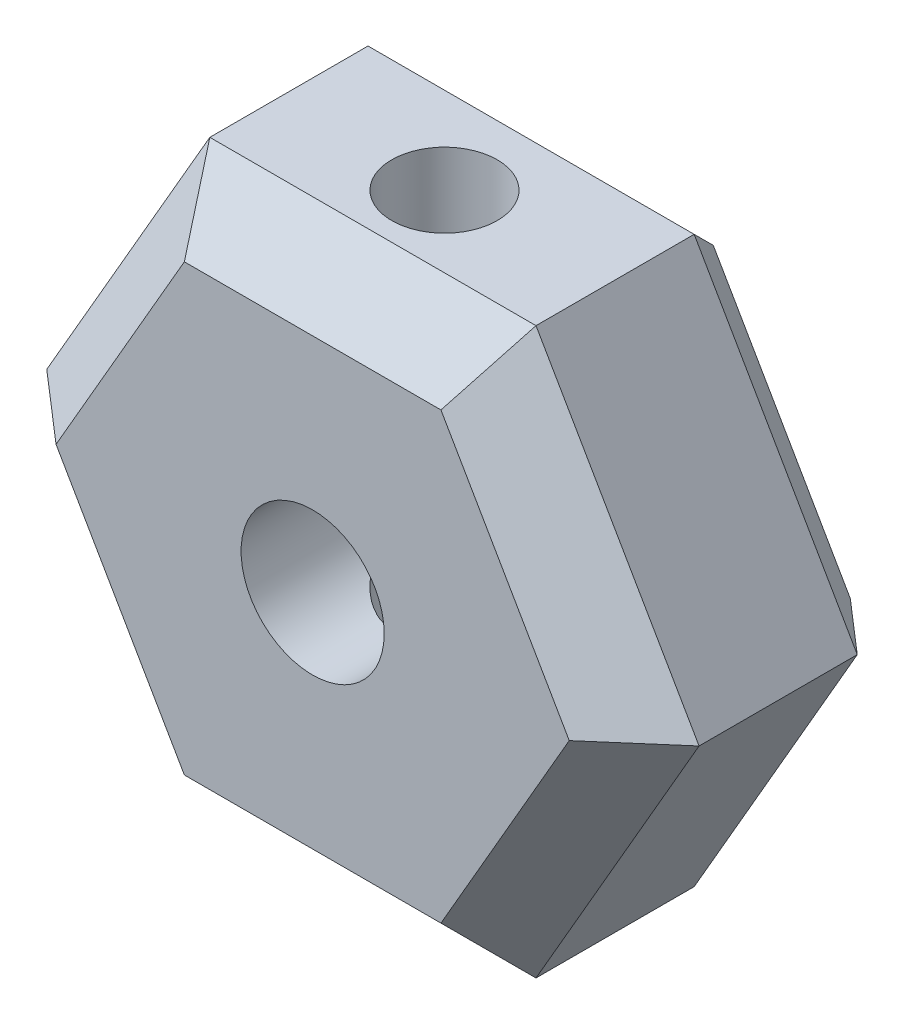
ISO-10303-21;
HEADER;
FILE_DESCRIPTION(('STEP AP214'),'2;1');
FILE_NAME('part.step','',(''),(''),'','','');
FILE_SCHEMA(('AUTOMOTIVE_DESIGN { 1 0 10303 214 1 1 1 1 }'));
ENDSEC;
DATA;
#1=APPLICATION_CONTEXT('core data for automotive mechanical design processes');
#2=APPLICATION_PROTOCOL_DEFINITION('international standard','automotive_design',2000,#1);
#3=PRODUCT_CONTEXT('',#1,'mechanical');
#4=PRODUCT('Part','Part','',(#3));
#5=PRODUCT_RELATED_PRODUCT_CATEGORY('part','',(#4));
#6=PRODUCT_DEFINITION_FORMATION('','',#4);
#7=PRODUCT_DEFINITION_CONTEXT('part definition',#1,'design');
#8=PRODUCT_DEFINITION('design','',#6,#7);
#9=PRODUCT_DEFINITION_SHAPE('','',#8);
#10=(LENGTH_UNIT() NAMED_UNIT(*) SI_UNIT(.MILLI.,.METRE.));
#11=(NAMED_UNIT(*) PLANE_ANGLE_UNIT() SI_UNIT($,.RADIAN.));
#12=(NAMED_UNIT(*) SI_UNIT($,.STERADIAN.) SOLID_ANGLE_UNIT());
#13=UNCERTAINTY_MEASURE_WITH_UNIT(LENGTH_MEASURE(1.E-05),#10,'distance_accuracy_value','');
#14=(GEOMETRIC_REPRESENTATION_CONTEXT(3) GLOBAL_UNCERTAINTY_ASSIGNED_CONTEXT((#13)) GLOBAL_UNIT_ASSIGNED_CONTEXT((#10,
#11,#12)) REPRESENTATION_CONTEXT('',''));
#15=CARTESIAN_POINT('',(0.,0.,0.));
#16=DIRECTION('',(0.,0.,1.));
#17=DIRECTION('',(1.,0.,0.));
#18=AXIS2_PLACEMENT_3D('',#15,#16,#17);
#19=CARTESIAN_POINT('',(0.,0.,7.));
#20=DIRECTION('',(0.,0.,1.));
#21=DIRECTION('',(1.,0.,0.));
#22=AXIS2_PLACEMENT_3D('',#19,#20,#21);
#23=PLANE('',#22);
#24=DIRECTION('',(-0.5,-0.866025403784439,0.));
#25=VECTOR('',#24,1.);
#26=CARTESIAN_POINT('',(-7.27461339178929,-0.800000000000001,7.));
#27=LINE('',#26,#25);
#28=CARTESIAN_POINT('',(-3.40636658821879,5.9,7.));
#29=VERTEX_POINT('',#28);
#30=CARTESIAN_POINT('',(-6.81273317643759,0.,7.));
#31=VERTEX_POINT('',#30);
#32=EDGE_CURVE('E138',#29,#31,#27,.T.);
#33=ORIENTED_EDGE('',*,*,#32,.T.);
#34=DIRECTION('',(0.5,-0.866025403784439,0.));
#35=VECTOR('',#34,1.);
#36=CARTESIAN_POINT('',(-2.94448637286709,-6.7,7.));
#37=LINE('',#36,#35);
#38=CARTESIAN_POINT('',(-3.40636658821879,-5.9,7.));
#39=VERTEX_POINT('',#38);
#40=EDGE_CURVE('E185',#31,#39,#37,.T.);
#41=ORIENTED_EDGE('',*,*,#40,.T.);
#42=DIRECTION('',(1.,0.,0.));
#43=VECTOR('',#42,1.);
#44=CARTESIAN_POINT('',(4.33012701892219,-5.9,7.));
#45=LINE('',#44,#43);
#46=CARTESIAN_POINT('',(3.40636658821879,-5.9,7.));
#47=VERTEX_POINT('',#46);
#48=EDGE_CURVE('E182',#39,#47,#45,.T.);
#49=ORIENTED_EDGE('',*,*,#48,.T.);
#50=DIRECTION('',(0.5,0.866025403784439,0.));
#51=VECTOR('',#50,1.);
#52=CARTESIAN_POINT('',(7.27461339178928,0.800000000000004,7.));
#53=LINE('',#52,#51);
#54=CARTESIAN_POINT('',(6.81273317643758,0.,7.));
#55=VERTEX_POINT('',#54);
#56=EDGE_CURVE('E179',#47,#55,#53,.T.);
#57=ORIENTED_EDGE('',*,*,#56,.T.);
#58=DIRECTION('',(-0.5,0.866025403784439,0.));
#59=VECTOR('',#58,1.);
#60=CARTESIAN_POINT('',(2.94448637286709,6.7,7.));
#61=LINE('',#60,#59);
#62=CARTESIAN_POINT('',(3.40636658821879,5.9,7.));
#63=VERTEX_POINT('',#62);
#64=EDGE_CURVE('E141',#55,#63,#61,.T.);
#65=ORIENTED_EDGE('',*,*,#64,.T.);
#66=DIRECTION('',(-1.,0.,0.));
#67=VECTOR('',#66,1.);
#68=CARTESIAN_POINT('',(-4.33012701892219,5.9,7.));
#69=LINE('',#68,#67);
#70=EDGE_CURVE('E133',#63,#29,#69,.T.);
#71=ORIENTED_EDGE('',*,*,#70,.T.);
#72=EDGE_LOOP('',(#33,#41,#49,#57,#65,#71));
#73=FACE_BOUND('',#72,.T.);
#74=CARTESIAN_POINT('',(0.,0.,7.));
#75=DIRECTION('',(0.,0.,1.));
#76=DIRECTION('',(1.,0.,0.));
#77=AXIS2_PLACEMENT_3D('',#74,#75,#76);
#78=CIRCLE('',#77,1.9);
#79=CARTESIAN_POINT('',(1.9,0.,7.));
#80=VERTEX_POINT('',#79);
#81=EDGE_CURVE('E576',#80,#80,#78,.T.);
#82=ORIENTED_EDGE('',*,*,#81,.F.);
#83=EDGE_LOOP('',(#82));
#84=FACE_BOUND('',#83,.T.);
#85=ADVANCED_FACE('F41',(#73,#84),#23,.T.);
#86=CARTESIAN_POINT('',(0.,0.,0.));
#87=DIRECTION('',(0.,0.,1.));
#88=DIRECTION('',(1.,0.,0.));
#89=AXIS2_PLACEMENT_3D('',#86,#87,#88);
#90=PLANE('',#89);
#91=DIRECTION('',(0.5,0.866025403784439,0.));
#92=VECTOR('',#91,1.);
#93=CARTESIAN_POINT('',(-5.45596004384196,3.15,0.));
#94=LINE('',#93,#92);
#95=CARTESIAN_POINT('',(-7.27461339178928,0.,0.));
#96=VERTEX_POINT('',#95);
#97=CARTESIAN_POINT('',(-3.63730669589464,6.3,0.));
#98=VERTEX_POINT('',#97);
#99=EDGE_CURVE('E225',#96,#98,#94,.T.);
#100=ORIENTED_EDGE('',*,*,#99,.T.);
#101=DIRECTION('',(1.,0.,0.));
#102=VECTOR('',#101,1.);
#103=CARTESIAN_POINT('',(0.,6.3,0.));
#104=LINE('',#103,#102);
#105=CARTESIAN_POINT('',(3.63730669589463,6.3,0.));
#106=VERTEX_POINT('',#105);
#107=EDGE_CURVE('E240',#98,#106,#104,.T.);
#108=ORIENTED_EDGE('',*,*,#107,.T.);
#109=DIRECTION('',(0.5,-0.866025403784439,0.));
#110=VECTOR('',#109,1.);
#111=CARTESIAN_POINT('',(5.45596004384196,3.15,0.));
#112=LINE('',#111,#110);
#113=CARTESIAN_POINT('',(7.27461339178927,0.,0.));
#114=VERTEX_POINT('',#113);
#115=EDGE_CURVE('E237',#106,#114,#112,.T.);
#116=ORIENTED_EDGE('',*,*,#115,.T.);
#117=DIRECTION('',(-0.5,-0.866025403784439,0.));
#118=VECTOR('',#117,1.);
#119=CARTESIAN_POINT('',(5.45596004384196,-3.14999999999999,0.));
#120=LINE('',#119,#118);
#121=CARTESIAN_POINT('',(3.63730669589463,-6.3,0.));
#122=VERTEX_POINT('',#121);
#123=EDGE_CURVE('E234',#114,#122,#120,.T.);
#124=ORIENTED_EDGE('',*,*,#123,.T.);
#125=DIRECTION('',(-1.,0.,0.));
#126=VECTOR('',#125,1.);
#127=CARTESIAN_POINT('',(0.,-6.3,0.));
#128=LINE('',#127,#126);
#129=CARTESIAN_POINT('',(-3.63730669589464,-6.3,0.));
#130=VERTEX_POINT('',#129);
#131=EDGE_CURVE('E231',#122,#130,#128,.T.);
#132=ORIENTED_EDGE('',*,*,#131,.T.);
#133=DIRECTION('',(-0.5,0.866025403784439,0.));
#134=VECTOR('',#133,1.);
#135=CARTESIAN_POINT('',(-5.45596004384196,-3.15,0.));
#136=LINE('',#135,#134);
#137=EDGE_CURVE('E228',#130,#96,#136,.T.);
#138=ORIENTED_EDGE('',*,*,#137,.T.);
#139=EDGE_LOOP('',(#100,#108,#116,#124,#132,#138));
#140=FACE_BOUND('',#139,.T.);
#141=CARTESIAN_POINT('',(0.,0.,0.));
#142=DIRECTION('',(0.,0.,1.));
#143=DIRECTION('',(1.,0.,0.));
#144=AXIS2_PLACEMENT_3D('',#141,#142,#143);
#145=CIRCLE('',#144,1.9);
#146=CARTESIAN_POINT('',(1.9,0.,0.));
#147=VERTEX_POINT('',#146);
#148=EDGE_CURVE('E582',#147,#147,#145,.T.);
#149=ORIENTED_EDGE('',*,*,#148,.T.);
#150=EDGE_LOOP('',(#149));
#151=FACE_BOUND('',#150,.T.);
#152=ADVANCED_FACE('F286',(#140,#151),#90,.F.);
#153=CARTESIAN_POINT('',(4.33012701892219,-7.5,7.));
#154=DIRECTION('',(-0.866025403784439,0.5,0.));
#155=DIRECTION('',(-0.5,-0.866025403784439,0.));
#156=AXIS2_PLACEMENT_3D('',#153,#154,#155);
#157=PLANE('',#156);
#158=DIRECTION('',(0.,0.,-1.));
#159=VECTOR('',#158,1.);
#160=CARTESIAN_POINT('',(4.33012701892219,-7.5,7.));
#161=LINE('',#160,#159);
#162=CARTESIAN_POINT('',(4.33012701892219,-7.5,5.39999999999999));
#163=VERTEX_POINT('',#162);
#164=CARTESIAN_POINT('',(4.33012701892219,-7.5,1.2));
#165=VERTEX_POINT('',#164);
#166=EDGE_CURVE('E572',#163,#165,#161,.T.);
#167=ORIENTED_EDGE('',*,*,#166,.T.);
#168=DIRECTION('',(0.5,0.866025403784439,0.));
#169=VECTOR('',#168,1.);
#170=CARTESIAN_POINT('',(4.33012701892219,-7.5,1.2));
#171=LINE('',#170,#169);
#172=CARTESIAN_POINT('',(8.66025403784438,0.,1.2));
#173=VERTEX_POINT('',#172);
#174=EDGE_CURVE('E247',#165,#173,#171,.T.);
#175=ORIENTED_EDGE('',*,*,#174,.T.);
#176=DIRECTION('',(0.,0.,-1.));
#177=VECTOR('',#176,1.);
#178=CARTESIAN_POINT('',(8.66025403784438,0.,7.));
#179=LINE('',#178,#177);
#180=CARTESIAN_POINT('',(8.66025403784438,0.,5.39999999999999));
#181=VERTEX_POINT('',#180);
#182=EDGE_CURVE('E162',#181,#173,#179,.T.);
#183=ORIENTED_EDGE('',*,*,#182,.F.);
#184=DIRECTION('',(-0.5,-0.866025403784439,0.));
#185=VECTOR('',#184,1.);
#186=CARTESIAN_POINT('',(4.33012701892219,-7.5,5.39999999999999));
#187=LINE('',#186,#185);
#188=EDGE_CURVE('E195',#181,#163,#187,.T.);
#189=ORIENTED_EDGE('',*,*,#188,.T.);
#190=EDGE_LOOP('',(#167,#175,#183,#189));
#191=FACE_BOUND('',#190,.T.);
#192=ADVANCED_FACE('F341',(#191),#157,.F.);
#193=CARTESIAN_POINT('',(8.66025403784438,0.,7.));
#194=DIRECTION('',(-0.866025403784439,-0.5,0.));
#195=DIRECTION('',(0.5,-0.866025403784439,0.));
#196=AXIS2_PLACEMENT_3D('',#193,#194,#195);
#197=PLANE('',#196);
#198=ORIENTED_EDGE('',*,*,#182,.T.);
#199=DIRECTION('',(-0.5,0.866025403784439,0.));
#200=VECTOR('',#199,1.);
#201=CARTESIAN_POINT('',(8.66025403784438,0.,1.2));
#202=LINE('',#201,#200);
#203=CARTESIAN_POINT('',(4.33012701892219,7.5,1.2));
#204=VERTEX_POINT('',#203);
#205=EDGE_CURVE('E244',#173,#204,#202,.T.);
#206=ORIENTED_EDGE('',*,*,#205,.T.);
#207=DIRECTION('',(0.,0.,-1.));
#208=VECTOR('',#207,1.);
#209=CARTESIAN_POINT('',(4.33012701892219,7.5,7.));
#210=LINE('',#209,#208);
#211=CARTESIAN_POINT('',(4.33012701892219,7.5,5.39999999999999));
#212=VERTEX_POINT('',#211);
#213=EDGE_CURVE('E166',#212,#204,#210,.T.);
#214=ORIENTED_EDGE('',*,*,#213,.F.);
#215=DIRECTION('',(0.5,-0.866025403784439,0.));
#216=VECTOR('',#215,1.);
#217=CARTESIAN_POINT('',(8.66025403784438,0.,5.39999999999999));
#218=LINE('',#217,#216);
#219=EDGE_CURVE('E198',#212,#181,#218,.T.);
#220=ORIENTED_EDGE('',*,*,#219,.T.);
#221=EDGE_LOOP('',(#198,#206,#214,#220));
#222=FACE_BOUND('',#221,.T.);
#223=ADVANCED_FACE('F299',(#222),#197,.F.);
#224=CARTESIAN_POINT('',(4.33012701892219,7.5,7.));
#225=DIRECTION('',(0.,-1.,0.));
#226=DIRECTION('',(0.,0.,-1.));
#227=AXIS2_PLACEMENT_3D('',#224,#225,#226);
#228=PLANE('',#227);
#229=CARTESIAN_POINT('',(0.,7.50000000000001,3.5));
#230=DIRECTION('',(0.,-1.,0.));
#231=DIRECTION('',(0.,0.,-1.));
#232=AXIS2_PLACEMENT_3D('',#229,#230,#231);
#233=CIRCLE('',#232,1.4);
#234=CARTESIAN_POINT('',(0.,7.50000000000001,2.1));
#235=VERTEX_POINT('',#234);
#236=EDGE_CURVE('E318',#235,#235,#233,.T.);
#237=ORIENTED_EDGE('',*,*,#236,.T.);
#238=EDGE_LOOP('',(#237));
#239=FACE_BOUND('',#238,.T.);
#240=ORIENTED_EDGE('',*,*,#213,.T.);
#241=DIRECTION('',(-1.,0.,0.));
#242=VECTOR('',#241,1.);
#243=CARTESIAN_POINT('',(4.33012701892219,7.5,1.2));
#244=LINE('',#243,#242);
#245=CARTESIAN_POINT('',(-4.33012701892219,7.5,1.2));
#246=VERTEX_POINT('',#245);
#247=EDGE_CURVE('E206',#204,#246,#244,.T.);
#248=ORIENTED_EDGE('',*,*,#247,.T.);
#249=DIRECTION('',(0.,0.,-1.));
#250=VECTOR('',#249,1.);
#251=CARTESIAN_POINT('',(-4.33012701892219,7.5,7.));
#252=LINE('',#251,#250);
#253=CARTESIAN_POINT('',(-4.33012701892219,7.5,5.39999999999999));
#254=VERTEX_POINT('',#253);
#255=EDGE_CURVE('E306',#254,#246,#252,.T.);
#256=ORIENTED_EDGE('',*,*,#255,.F.);
#257=DIRECTION('',(1.,0.,0.));
#258=VECTOR('',#257,1.);
#259=CARTESIAN_POINT('',(4.33012701892219,7.5,5.39999999999999));
#260=LINE('',#259,#258);
#261=EDGE_CURVE('E151',#254,#212,#260,.T.);
#262=ORIENTED_EDGE('',*,*,#261,.T.);
#263=EDGE_LOOP('',(#240,#248,#256,#262));
#264=FACE_BOUND('',#263,.T.);
#265=ADVANCED_FACE('F303',(#239,#264),#228,.F.);
#266=CARTESIAN_POINT('',(-4.33012701892219,7.5,7.));
#267=DIRECTION('',(0.866025403784439,-0.5,0.));
#268=DIRECTION('',(0.5,0.866025403784439,0.));
#269=AXIS2_PLACEMENT_3D('',#266,#267,#268);
#270=PLANE('',#269);
#271=ORIENTED_EDGE('',*,*,#255,.T.);
#272=DIRECTION('',(-0.5,-0.866025403784439,0.));
#273=VECTOR('',#272,1.);
#274=CARTESIAN_POINT('',(-4.33012701892219,7.5,1.2));
#275=LINE('',#274,#273);
#276=CARTESIAN_POINT('',(-8.66025403784439,0.,1.2));
#277=VERTEX_POINT('',#276);
#278=EDGE_CURVE('E11',#246,#277,#275,.T.);
#279=ORIENTED_EDGE('',*,*,#278,.T.);
#280=DIRECTION('',(0.,0.,-1.));
#281=VECTOR('',#280,1.);
#282=CARTESIAN_POINT('',(-8.66025403784439,0.,7.));
#283=LINE('',#282,#281);
#284=CARTESIAN_POINT('',(-8.66025403784439,0.,5.39999999999999));
#285=VERTEX_POINT('',#284);
#286=EDGE_CURVE('E309',#285,#277,#283,.T.);
#287=ORIENTED_EDGE('',*,*,#286,.F.);
#288=DIRECTION('',(0.5,0.866025403784439,0.));
#289=VECTOR('',#288,1.);
#290=CARTESIAN_POINT('',(-4.33012701892219,7.5,5.39999999999999));
#291=LINE('',#290,#289);
#292=EDGE_CURVE('E203',#285,#254,#291,.T.);
#293=ORIENTED_EDGE('',*,*,#292,.T.);
#294=EDGE_LOOP('',(#271,#279,#287,#293));
#295=FACE_BOUND('',#294,.T.);
#296=ADVANCED_FACE('F350',(#295),#270,.F.);
#297=CARTESIAN_POINT('',(-8.66025403784439,0.,7.));
#298=DIRECTION('',(0.866025403784439,0.5,0.));
#299=DIRECTION('',(-0.5,0.866025403784439,0.));
#300=AXIS2_PLACEMENT_3D('',#297,#298,#299);
#301=PLANE('',#300);
#302=ORIENTED_EDGE('',*,*,#286,.T.);
#303=DIRECTION('',(0.5,-0.866025403784439,0.));
#304=VECTOR('',#303,1.);
#305=CARTESIAN_POINT('',(-8.66025403784439,0.,1.2));
#306=LINE('',#305,#304);
#307=CARTESIAN_POINT('',(-4.33012701892219,-7.5,1.2));
#308=VERTEX_POINT('',#307);
#309=EDGE_CURVE('E52',#277,#308,#306,.T.);
#310=ORIENTED_EDGE('',*,*,#309,.T.);
#311=DIRECTION('',(0.,0.,-1.));
#312=VECTOR('',#311,1.);
#313=CARTESIAN_POINT('',(-4.33012701892219,-7.5,7.));
#314=LINE('',#313,#312);
#315=CARTESIAN_POINT('',(-4.33012701892219,-7.5,5.39999999999999));
#316=VERTEX_POINT('',#315);
#317=EDGE_CURVE('E575',#316,#308,#314,.T.);
#318=ORIENTED_EDGE('',*,*,#317,.F.);
#319=DIRECTION('',(-0.5,0.866025403784439,0.));
#320=VECTOR('',#319,1.);
#321=CARTESIAN_POINT('',(-8.66025403784439,0.,5.39999999999999));
#322=LINE('',#321,#320);
#323=EDGE_CURVE('E188',#316,#285,#322,.T.);
#324=ORIENTED_EDGE('',*,*,#323,.T.);
#325=EDGE_LOOP('',(#302,#310,#318,#324));
#326=FACE_BOUND('',#325,.T.);
#327=ADVANCED_FACE('F346',(#326),#301,.F.);
#328=CARTESIAN_POINT('',(-4.33012701892219,-7.5,7.));
#329=DIRECTION('',(0.,1.,0.));
#330=DIRECTION('',(0.,0.,1.));
#331=AXIS2_PLACEMENT_3D('',#328,#329,#330);
#332=PLANE('',#331);
#333=CARTESIAN_POINT('',(0.,-7.5,3.5));
#334=DIRECTION('',(0.,-1.,0.));
#335=DIRECTION('',(0.,0.,-1.));
#336=AXIS2_PLACEMENT_3D('',#333,#334,#335);
#337=CIRCLE('',#336,1.4);
#338=CARTESIAN_POINT('',(0.,-7.5,2.1));
#339=VERTEX_POINT('',#338);
#340=EDGE_CURVE('E221',#339,#339,#337,.T.);
#341=ORIENTED_EDGE('',*,*,#340,.F.);
#342=EDGE_LOOP('',(#341));
#343=FACE_BOUND('',#342,.T.);
#344=ORIENTED_EDGE('',*,*,#317,.T.);
#345=DIRECTION('',(1.,0.,0.));
#346=VECTOR('',#345,1.);
#347=CARTESIAN_POINT('',(-4.33012701892219,-7.5,1.2));
#348=LINE('',#347,#346);
#349=EDGE_CURVE('E250',#308,#165,#348,.T.);
#350=ORIENTED_EDGE('',*,*,#349,.T.);
#351=ORIENTED_EDGE('',*,*,#166,.F.);
#352=DIRECTION('',(-1.,0.,0.));
#353=VECTOR('',#352,1.);
#354=CARTESIAN_POINT('',(-4.33012701892219,-7.5,5.39999999999999));
#355=LINE('',#354,#353);
#356=EDGE_CURVE('E192',#163,#316,#355,.T.);
#357=ORIENTED_EDGE('',*,*,#356,.T.);
#358=EDGE_LOOP('',(#344,#350,#351,#357));
#359=FACE_BOUND('',#358,.T.);
#360=ADVANCED_FACE('F334',(#343,#359),#332,.F.);
#361=CARTESIAN_POINT('',(0.,0.,7.));
#362=DIRECTION('',(0.,0.,-1.));
#363=DIRECTION('',(-1.,0.,0.));
#364=AXIS2_PLACEMENT_3D('',#361,#362,#363);
#365=CYLINDRICAL_SURFACE('',#364,1.9);
#366=CARTESIAN_POINT('',(0.,1.9,2.1));
#367=CARTESIAN_POINT('',(0.0687841434595782,1.90000211675382,2.09999772030073));
#368=CARTESIAN_POINT('',(0.137557244291258,1.89623451105031,2.10509782059149));
#369=CARTESIAN_POINT('',(0.272864783479331,1.88153649341743,2.12514519340404));
#370=CARTESIAN_POINT('',(0.339398348980658,1.87060332194124,2.14009625966485));
#371=CARTESIAN_POINT('',(0.468038145568906,1.84262254648485,2.17885052152287));
#372=CARTESIAN_POINT('',(0.530165186822579,1.82560634621971,2.20260827532655));
#373=CARTESIAN_POINT('',(0.649190666680503,1.78675019381165,2.25788000539543));
#374=CARTESIAN_POINT('',(0.706088376783239,1.76490957101335,2.28939506009268));
#375=CARTESIAN_POINT('',(0.818942367525374,1.71565218990302,2.36234678927538));
#376=CARTESIAN_POINT('',(0.874336456337021,1.68790811360331,2.40442732628479));
#377=CARTESIAN_POINT('',(0.977757516272454,1.63018590802803,2.49563268980914));
#378=CARTESIAN_POINT('',(1.0257733082431,1.60020448900086,2.54476799160342));
#379=CARTESIAN_POINT('',(1.1227726383369,1.53409877084207,2.65970008829287));
#380=CARTESIAN_POINT('',(1.17009752813755,1.49792341290221,2.72687440595895));
#381=CARTESIAN_POINT('',(1.25292258094274,1.42935750652528,2.86992439799439));
#382=CARTESIAN_POINT('',(1.28843993538106,1.39696150049659,2.94578720371571));
#383=CARTESIAN_POINT('',(1.33634282184493,1.35088939667092,3.07884872008069));
#384=CARTESIAN_POINT('',(1.35249119749808,1.33457944630724,3.13376823912102));
#385=CARTESIAN_POINT('',(1.37807261223795,1.30815044302801,3.24653721218218));
#386=CARTESIAN_POINT('',(1.38752086905248,1.29801736821088,3.30437970490783));
#387=CARTESIAN_POINT('',(1.39909204373161,1.28554385897506,3.42214532495909));
#388=CARTESIAN_POINT('',(1.40115618788817,1.28326595276215,3.48208132823501));
#389=CARTESIAN_POINT('',(1.39759712393426,1.28713866428736,3.601464506483));
#390=CARTESIAN_POINT('',(1.39196893842244,1.29329473932631,3.66091133988568));
#391=CARTESIAN_POINT('',(1.37254954230662,1.3138949171613,3.78347245441111));
#392=CARTESIAN_POINT('',(1.35796596470102,1.32913868670872,3.84631981592621));
#393=CARTESIAN_POINT('',(1.32105950630593,1.36582374602091,3.96781936740607));
#394=CARTESIAN_POINT('',(1.29871816600748,1.38727979742079,4.02646114502663));
#395=CARTESIAN_POINT('',(1.23795410066304,1.44210909727707,4.15919771216748));
#396=CARTESIAN_POINT('',(1.19663768664491,1.47700180062216,4.23133203732312));
#397=CARTESIAN_POINT('',(1.10253498299398,1.54852378501615,4.3667308670521));
#398=CARTESIAN_POINT('',(1.04973529089275,1.58515505581053,4.4299848639788));
#399=CARTESIAN_POINT('',(0.932324855731339,1.65697985430152,4.54775095156294));
#400=CARTESIAN_POINT('',(0.867549090163071,1.69214363909706,4.60211795534442));
#401=CARTESIAN_POINT('',(0.727423856460964,1.75692310767703,4.6991993734987));
#402=CARTESIAN_POINT('',(0.65209913521971,1.78655140804411,4.74194039006743));
#403=CARTESIAN_POINT('',(0.512825284107027,1.83054732992554,4.80432137792727));
#404=CARTESIAN_POINT('',(0.450888239883205,1.84687991788722,4.82707358387114));
#405=CARTESIAN_POINT('',(0.323205719891138,1.87343976725731,4.86379589579124));
#406=CARTESIAN_POINT('',(0.257463105032741,1.88367155131224,4.8777725076974));
#407=CARTESIAN_POINT('',(0.123657677259072,1.8971679061331,4.896168192157));
#408=CARTESIAN_POINT('',(0.0555865937172618,1.90040428030241,4.90054858591717));
#409=CARTESIAN_POINT('',(-0.0804205443920804,1.89951457079674,4.89934128244));
#410=CARTESIAN_POINT('',(-0.148356600555419,1.89538857465738,4.89375370371785));
#411=CARTESIAN_POINT('',(-0.277679498361625,1.88065567505121,4.87364770944877));
#412=CARTESIAN_POINT('',(-0.339209029698174,1.87047438975612,4.85971541418794));
#413=CARTESIAN_POINT('',(-0.458811637625449,1.84478643770938,4.82415548731847));
#414=CARTESIAN_POINT('',(-0.516883984442782,1.82927865123618,4.80252623764401));
#415=CARTESIAN_POINT('',(-0.632897189041982,1.79260262127453,4.75051625687439));
#416=CARTESIAN_POINT('',(-0.69048141238114,1.77108967750562,4.719588591386));
#417=CARTESIAN_POINT('',(-0.79979497178779,1.72448986042353,4.65087050035516));
#418=CARTESIAN_POINT('',(-0.851520828623615,1.69940088310293,4.61307603101453));
#419=CARTESIAN_POINT('',(-0.95766500898285,1.64229744742273,4.52397406455165));
#420=CARTESIAN_POINT('',(-1.01083973215656,1.60985639823868,4.47145946486776));
#421=CARTESIAN_POINT('',(-1.10815061627961,1.54448662400514,4.35880825231534));
#422=CARTESIAN_POINT('',(-1.15227777154495,1.51155744770237,4.29866414069101));
#423=CARTESIAN_POINT('',(-1.22741320273067,1.45105818446999,4.17684088466011));
#424=CARTESIAN_POINT('',(-1.25924013015879,1.42327202856292,4.11577616264497));
#425=CARTESIAN_POINT('',(-1.31408148827124,1.37279947319823,3.98786142514982));
#426=CARTESIAN_POINT('',(-1.33711413712893,1.35010257160306,3.92102372527513));
#427=CARTESIAN_POINT('',(-1.36880717362255,1.3178598928989,3.7988956326572));
#428=CARTESIAN_POINT('',(-1.37958548148078,1.30646842792046,3.7446547979337));
#429=CARTESIAN_POINT('',(-1.39464711391758,1.29038225864231,3.63433536008509));
#430=CARTESIAN_POINT('',(-1.39894094621448,1.28567672091701,3.57825988089946));
#431=CARTESIAN_POINT('',(-1.40071377486937,1.28374606442873,3.46571122908163));
#432=CARTESIAN_POINT('',(-1.39817421574113,1.28654131334983,3.40923738976344));
#433=CARTESIAN_POINT('',(-1.38645346148569,1.29915949759009,3.29776307703709));
#434=CARTESIAN_POINT('',(-1.37726304936555,1.3089921854389,3.24276475826968));
#435=CARTESIAN_POINT('',(-1.34946308549456,1.33770101461708,3.12068467080471));
#436=CARTESIAN_POINT('',(-1.32895378563643,1.35832426273479,3.05445807125887));
#437=CARTESIAN_POINT('',(-1.27936661386423,1.40512732603195,2.92737455741859));
#438=CARTESIAN_POINT('',(-1.25026772957364,1.43132072280087,2.86653129221016));
#439=CARTESIAN_POINT('',(-1.17495353991677,1.4941618402374,2.73394586612688));
#440=CARTESIAN_POINT('',(-1.12622371662423,1.53166236244231,2.66403484676995));
#441=CARTESIAN_POINT('',(-1.01687677591846,1.60634979393746,2.53398838419829));
#442=CARTESIAN_POINT('',(-0.956252969610223,1.64353651442241,2.47385847661519));
#443=CARTESIAN_POINT('',(-0.823411351752335,1.71396180588537,2.36447667071742));
#444=CARTESIAN_POINT('',(-0.751157989580684,1.7471877087732,2.31525926447447));
#445=CARTESIAN_POINT('',(-0.596339997818307,1.80587426435838,2.23030609839017));
#446=CARTESIAN_POINT('',(-0.513801345298897,1.83135394255661,2.19453725548184));
#447=CARTESIAN_POINT('',(-0.359481932186761,1.86698759286799,2.14505869164714));
#448=CARTESIAN_POINT('',(-0.289178023539132,1.87925423688163,2.12826663570456));
#449=CARTESIAN_POINT('',(-0.145910191409919,1.89575546939163,2.10574379885368));
#450=CARTESIAN_POINT('',(-0.0729488855405462,1.89999775508097,2.10000241773049));
#451=CARTESIAN_POINT('',(0.,1.9,2.1));
#452=B_SPLINE_CURVE_WITH_KNOTS('',3,(#366,#367,#368,#369,#370,#371,#372,#373,#374,#375,#376,
#377,#378,#379,#380,#381,#382,#383,#384,#385,#386,#387,#388,#389,#390,#391,#392,#393,#394,#395,
#396,#397,#398,#399,#400,#401,#402,#403,#404,#405,#406,#407,#408,#409,#410,#411,#412,#413,#414,
#415,#416,#417,#418,#419,#420,#421,#422,#423,#424,#425,#426,#427,#428,#429,#430,#431,#432,#433,
#434,#435,#436,#437,#438,#439,#440,#441,#442,#443,#444,#445,#446,#447,#448,#449,#450,#451),
.UNSPECIFIED.,.T.,.F.,(4,2,2,2,2,2,2,2,2,2,2,2,2,2,2,2,2,2,2,2,2,2,2,2,2,2,2,2,2,2,2,2,2,2,2,2,
2,2,2,2,2,2,4),(0.,0.206054152649566,0.412187705933169,0.617272105785463,0.822385032909205,
1.04626017687981,1.27047124768057,1.53867477711422,1.80648608196649,1.98443125268575,
2.16197095741648,2.34092068043603,2.51998624955705,2.71778447281641,2.91605661701214,
3.18513708047876,3.4545332972428,3.7279635217869,4.00076272632448,4.20384832896068,
4.40678319244113,4.61053451760019,4.81428342025409,5.00516864319834,5.19609401806172,
5.40176683775088,5.60756117119214,5.85106746176391,6.09481496712449,6.31684102311155,
6.53840460301532,6.707106620025,6.87553497071421,7.04442113531016,7.21354179777154,
7.42934577192715,7.64568209703957,7.92363179507935,8.20173825585369,8.48071160198203,
8.75899412072013,8.97773436798237,9.1962646867559),.UNSPECIFIED.);
#453=CARTESIAN_POINT('',(0.,1.9,2.1));
#454=VERTEX_POINT('',#453);
#455=EDGE_CURVE('E169',#454,#454,#452,.T.);
#456=ORIENTED_EDGE('',*,*,#455,.F.);
#457=EDGE_LOOP('',(#456));
#458=FACE_BOUND('',#457,.T.);
#459=CARTESIAN_POINT('',(0.,-1.9,2.1));
#460=CARTESIAN_POINT('',(-0.0687841434595843,-1.90000211675382,2.09999772030073));
#461=CARTESIAN_POINT('',(-0.137557244291264,-1.89623451105031,2.10509782059149));
#462=CARTESIAN_POINT('',(-0.272864783479337,-1.88153649341743,2.12514519340404));
#463=CARTESIAN_POINT('',(-0.339398348980665,-1.87060332194124,2.14009625966485));
#464=CARTESIAN_POINT('',(-0.468038145568912,-1.84262254648485,2.17885052152287));
#465=CARTESIAN_POINT('',(-0.530165186822585,-1.82560634621971,2.20260827532655));
#466=CARTESIAN_POINT('',(-0.64919066668051,-1.78675019381165,2.25788000539543));
#467=CARTESIAN_POINT('',(-0.706088376783245,-1.76490957101335,2.28939506009268));
#468=CARTESIAN_POINT('',(-0.81894236752538,-1.71565218990302,2.36234678927539));
#469=CARTESIAN_POINT('',(-0.874336456337027,-1.6879081136033,2.40442732628479));
#470=CARTESIAN_POINT('',(-0.97775751627246,-1.63018590802802,2.49563268980914));
#471=CARTESIAN_POINT('',(-1.02577330824311,-1.60020448900085,2.54476799160342));
#472=CARTESIAN_POINT('',(-1.12277263833691,-1.53409877084206,2.65970008829287));
#473=CARTESIAN_POINT('',(-1.17009752813756,-1.49792341290221,2.72687440595895));
#474=CARTESIAN_POINT('',(-1.25292258094275,-1.42935750652527,2.86992439799439));
#475=CARTESIAN_POINT('',(-1.28843993538106,-1.39696150049659,2.94578720371571));
#476=CARTESIAN_POINT('',(-1.33634282184494,-1.35088939667091,3.0788487200807));
#477=CARTESIAN_POINT('',(-1.35249119749809,-1.33457944630723,3.13376823912102));
#478=CARTESIAN_POINT('',(-1.37807261223795,-1.308150443028,3.24653721218218));
#479=CARTESIAN_POINT('',(-1.38752086905249,-1.29801736821087,3.30437970490783));
#480=CARTESIAN_POINT('',(-1.39909204373161,-1.28554385897506,3.42214532495909));
#481=CARTESIAN_POINT('',(-1.40115618788818,-1.28326595276214,3.48208132823501));
#482=CARTESIAN_POINT('',(-1.39759712393426,-1.28713866428735,3.601464506483));
#483=CARTESIAN_POINT('',(-1.39196893842244,-1.29329473932631,3.66091133988567));
#484=CARTESIAN_POINT('',(-1.37254954230663,-1.3138949171613,3.78347245441111));
#485=CARTESIAN_POINT('',(-1.35796596470103,-1.32913868670871,3.84631981592621));
#486=CARTESIAN_POINT('',(-1.32105950630593,-1.36582374602091,3.96781936740606));
#487=CARTESIAN_POINT('',(-1.29871816600748,-1.38727979742078,4.02646114502663));
#488=CARTESIAN_POINT('',(-1.23795410066305,-1.44210909727706,4.15919771216748));
#489=CARTESIAN_POINT('',(-1.19663768664492,-1.47700180062215,4.23133203732312));
#490=CARTESIAN_POINT('',(-1.10253498299399,-1.54852378501615,4.36673086705209));
#491=CARTESIAN_POINT('',(-1.04973529089276,-1.58515505581052,4.42998486397879));
#492=CARTESIAN_POINT('',(-0.932324855731349,-1.65697985430152,4.54775095156294));
#493=CARTESIAN_POINT('',(-0.86754909016308,-1.69214363909706,4.60211795534442));
#494=CARTESIAN_POINT('',(-0.727423856460973,-1.75692310767703,4.6991993734987));
#495=CARTESIAN_POINT('',(-0.652099135219719,-1.7865514080441,4.74194039006743));
#496=CARTESIAN_POINT('',(-0.512825284107037,-1.83054732992553,4.80432137792727));
#497=CARTESIAN_POINT('',(-0.450888239883216,-1.84687991788722,4.82707358387114));
#498=CARTESIAN_POINT('',(-0.323205719891149,-1.87343976725731,4.86379589579124));
#499=CARTESIAN_POINT('',(-0.257463105032751,-1.88367155131224,4.8777725076974));
#500=CARTESIAN_POINT('',(-0.123657677259082,-1.8971679061331,4.896168192157));
#501=CARTESIAN_POINT('',(-0.0555865937172712,-1.90040428030241,4.90054858591717));
#502=CARTESIAN_POINT('',(0.0804205443920713,-1.89951457079674,4.89934128244));
#503=CARTESIAN_POINT('',(0.14835660055541,-1.89538857465738,4.89375370371785));
#504=CARTESIAN_POINT('',(0.277679498361616,-1.88065567505121,4.87364770944877));
#505=CARTESIAN_POINT('',(0.339209029698165,-1.87047438975612,4.85971541418794));
#506=CARTESIAN_POINT('',(0.458811637625441,-1.84478643770938,4.82415548731847));
#507=CARTESIAN_POINT('',(0.516883984442773,-1.82927865123619,4.80252623764401));
#508=CARTESIAN_POINT('',(0.632897189041973,-1.79260262127453,4.75051625687439));
#509=CARTESIAN_POINT('',(0.690481412381132,-1.77108967750562,4.719588591386));
#510=CARTESIAN_POINT('',(0.799794971787782,-1.72448986042353,4.65087050035516));
#511=CARTESIAN_POINT('',(0.851520828623607,-1.69940088310293,4.61307603101453));
#512=CARTESIAN_POINT('',(0.957665008982842,-1.64229744742273,4.52397406455165));
#513=CARTESIAN_POINT('',(1.01083973215655,-1.60985639823869,4.47145946486776));
#514=CARTESIAN_POINT('',(1.1081506162796,-1.54448662400515,4.35880825231534));
#515=CARTESIAN_POINT('',(1.15227777154494,-1.51155744770238,4.29866414069102));
#516=CARTESIAN_POINT('',(1.22741320273066,-1.45105818446999,4.17684088466012));
#517=CARTESIAN_POINT('',(1.25924013015879,-1.42327202856293,4.11577616264497));
#518=CARTESIAN_POINT('',(1.31408148827124,-1.37279947319824,3.98786142514982));
#519=CARTESIAN_POINT('',(1.33711413712892,-1.35010257160307,3.92102372527514));
#520=CARTESIAN_POINT('',(1.36880717362254,-1.3178598928989,3.7988956326572));
#521=CARTESIAN_POINT('',(1.37958548148077,-1.30646842792047,3.7446547979337));
#522=CARTESIAN_POINT('',(1.39464711391758,-1.29038225864232,3.63433536008509));
#523=CARTESIAN_POINT('',(1.39894094621447,-1.28567672091701,3.57825988089946));
#524=CARTESIAN_POINT('',(1.40071377486936,-1.28374606442873,3.46571122908163));
#525=CARTESIAN_POINT('',(1.39817421574112,-1.28654131334984,3.40923738976344));
#526=CARTESIAN_POINT('',(1.38645346148568,-1.2991594975901,3.29776307703709));
#527=CARTESIAN_POINT('',(1.37726304936555,-1.30899218543891,3.24276475826968));
#528=CARTESIAN_POINT('',(1.34946308549456,-1.33770101461709,3.1206846708047));
#529=CARTESIAN_POINT('',(1.32895378563642,-1.3583242627348,3.05445807125887));
#530=CARTESIAN_POINT('',(1.27936661386422,-1.40512732603196,2.92737455741859));
#531=CARTESIAN_POINT('',(1.25026772957363,-1.43132072280088,2.86653129221016));
#532=CARTESIAN_POINT('',(1.17495353991677,-1.49416184023741,2.73394586612688));
#533=CARTESIAN_POINT('',(1.12622371662422,-1.53166236244231,2.66403484676995));
#534=CARTESIAN_POINT('',(1.01687677591846,-1.60634979393746,2.53398838419829));
#535=CARTESIAN_POINT('',(0.956252969610215,-1.64353651442241,2.47385847661519));
#536=CARTESIAN_POINT('',(0.823411351752328,-1.71396180588538,2.36447667071741));
#537=CARTESIAN_POINT('',(0.751157989580676,-1.7471877087732,2.31525926447447));
#538=CARTESIAN_POINT('',(0.596339997818299,-1.80587426435838,2.23030609839017));
#539=CARTESIAN_POINT('',(0.513801345298889,-1.83135394255661,2.19453725548184));
#540=CARTESIAN_POINT('',(0.359481932186754,-1.86698759286799,2.14505869164714));
#541=CARTESIAN_POINT('',(0.289178023539125,-1.87925423688163,2.12826663570456));
#542=CARTESIAN_POINT('',(0.145910191409913,-1.89575546939163,2.10574379885368));
#543=CARTESIAN_POINT('',(0.0729488855405402,-1.89999775508097,2.10000241773049));
#544=CARTESIAN_POINT('',(0.,-1.9,2.1));
#545=B_SPLINE_CURVE_WITH_KNOTS('',3,(#459,#460,#461,#462,#463,#464,#465,#466,#467,#468,#469,
#470,#471,#472,#473,#474,#475,#476,#477,#478,#479,#480,#481,#482,#483,#484,#485,#486,#487,#488,
#489,#490,#491,#492,#493,#494,#495,#496,#497,#498,#499,#500,#501,#502,#503,#504,#505,#506,#507,
#508,#509,#510,#511,#512,#513,#514,#515,#516,#517,#518,#519,#520,#521,#522,#523,#524,#525,#526,
#527,#528,#529,#530,#531,#532,#533,#534,#535,#536,#537,#538,#539,#540,#541,#542,#543,#544),
.UNSPECIFIED.,.T.,.F.,(4,2,2,2,2,2,2,2,2,2,2,2,2,2,2,2,2,2,2,2,2,2,2,2,2,2,2,2,2,2,2,2,2,2,2,2,
2,2,2,2,2,2,4),(0.,0.206054152649566,0.412187705933169,0.617272105785464,0.822385032909206,
1.04626017687981,1.27047124768057,1.53867477711422,1.8064860819665,1.98443125268575,
2.16197095741648,2.34092068043603,2.51998624955705,2.71778447281641,2.91605661701214,
3.18513708047876,3.45453329724279,3.7279635217869,4.00076272632447,4.20384832896068,
4.40678319244113,4.61053451760019,4.81428342025409,5.00516864319834,5.19609401806172,
5.40176683775088,5.60756117119214,5.85106746176391,6.09481496712449,6.31684102311155,
6.53840460301532,6.707106620025,6.87553497071421,7.04442113531016,7.21354179777155,
7.42934577192715,7.64568209703957,7.92363179507936,8.20173825585369,8.48071160198203,
8.75899412072013,8.97773436798237,9.1962646867559),.UNSPECIFIED.);
#546=CARTESIAN_POINT('',(0.,-1.9,2.1));
#547=VERTEX_POINT('',#546);
#548=EDGE_CURVE('E312',#547,#547,#545,.T.);
#549=ORIENTED_EDGE('',*,*,#548,.F.);
#550=EDGE_LOOP('',(#549));
#551=FACE_BOUND('',#550,.T.);
#552=ORIENTED_EDGE('',*,*,#81,.T.);
#553=EDGE_LOOP('',(#552));
#554=FACE_BOUND('',#553,.T.);
#555=ORIENTED_EDGE('',*,*,#148,.F.);
#556=EDGE_LOOP('',(#555));
#557=FACE_BOUND('',#556,.T.);
#558=ADVANCED_FACE('F319',(#458,#551,#554,#557),#365,.F.);
#559=CARTESIAN_POINT('',(0.,7.50000000000001,3.5));
#560=DIRECTION('',(0.,-1.,0.));
#561=DIRECTION('',(0.,0.,-1.));
#562=AXIS2_PLACEMENT_3D('',#559,#560,#561);
#563=CYLINDRICAL_SURFACE('',#562,1.4);
#564=ORIENTED_EDGE('',*,*,#548,.T.);
#565=EDGE_LOOP('',(#564));
#566=FACE_BOUND('',#565,.T.);
#567=ORIENTED_EDGE('',*,*,#340,.T.);
#568=EDGE_LOOP('',(#567));
#569=FACE_BOUND('',#568,.T.);
#570=ADVANCED_FACE('F322',(#566,#569),#563,.F.);
#571=ORIENTED_EDGE('',*,*,#455,.T.);
#572=EDGE_LOOP('',(#571));
#573=FACE_BOUND('',#572,.T.);
#574=ORIENTED_EDGE('',*,*,#236,.F.);
#575=EDGE_LOOP('',(#574));
#576=FACE_BOUND('',#575,.T.);
#577=ADVANCED_FACE('F325',(#573,#576),#563,.F.);
#578=CARTESIAN_POINT('',(5.10954988232819,2.95,7.));
#579=DIRECTION('',(0.612372435695796,0.353553390593275,0.707106781186546));
#580=DIRECTION('',(0.5,-0.866025403784439,0.));
#581=AXIS2_PLACEMENT_3D('',#578,#579,#580);
#582=PLANE('',#581);
#583=DIRECTION('',(0.755928946018453,0.,-0.654653670707979));
#584=VECTOR('',#583,1.);
#585=CARTESIAN_POINT('',(5.83948557980364,0.,7.84285714285714));
#586=LINE('',#585,#584);
#587=EDGE_CURVE('E155',#181,#55,#586,.F.);
#588=ORIENTED_EDGE('',*,*,#587,.F.);
#589=ORIENTED_EDGE('',*,*,#219,.F.);
#590=DIRECTION('',(0.377964473009227,0.654653670707976,-0.654653670707979));
#591=VECTOR('',#590,1.);
#592=CARTESIAN_POINT('',(2.91974278990182,5.05714285714286,7.84285714285714));
#593=LINE('',#592,#591);
#594=EDGE_CURVE('E218',#63,#212,#593,.T.);
#595=ORIENTED_EDGE('',*,*,#594,.F.);
#596=ORIENTED_EDGE('',*,*,#64,.F.);
#597=EDGE_LOOP('',(#588,#589,#595,#596));
#598=FACE_BOUND('',#597,.T.);
#599=ADVANCED_FACE('F332',(#598),#582,.T.);
#600=CARTESIAN_POINT('',(0.,5.9,7.));
#601=DIRECTION('',(0.,0.707106781186549,0.707106781186546));
#602=DIRECTION('',(1.,0.,0.));
#603=AXIS2_PLACEMENT_3D('',#600,#601,#602);
#604=PLANE('',#603);
#605=ORIENTED_EDGE('',*,*,#594,.T.);
#606=ORIENTED_EDGE('',*,*,#261,.F.);
#607=DIRECTION('',(-0.377964473009226,0.654653670707976,-0.654653670707979));
#608=VECTOR('',#607,1.);
#609=CARTESIAN_POINT('',(-2.91974278990182,5.05714285714286,7.84285714285714));
#610=LINE('',#609,#608);
#611=EDGE_CURVE('E149',#29,#254,#610,.T.);
#612=ORIENTED_EDGE('',*,*,#611,.F.);
#613=ORIENTED_EDGE('',*,*,#70,.F.);
#614=EDGE_LOOP('',(#605,#606,#612,#613));
#615=FACE_BOUND('',#614,.T.);
#616=ADVANCED_FACE('F150',(#615),#604,.T.);
#617=CARTESIAN_POINT('',(5.10954988232818,-2.95,7.));
#618=DIRECTION('',(0.612372435695796,-0.353553390593274,0.707106781186546));
#619=DIRECTION('',(-0.5,-0.866025403784439,0.));
#620=AXIS2_PLACEMENT_3D('',#617,#618,#619);
#621=PLANE('',#620);
#622=ORIENTED_EDGE('',*,*,#587,.T.);
#623=ORIENTED_EDGE('',*,*,#56,.F.);
#624=DIRECTION('',(0.377964473009227,-0.654653670707976,-0.654653670707979));
#625=VECTOR('',#624,1.);
#626=CARTESIAN_POINT('',(2.91974278990182,-5.05714285714286,7.84285714285714));
#627=LINE('',#626,#625);
#628=EDGE_CURVE('E156',#163,#47,#627,.F.);
#629=ORIENTED_EDGE('',*,*,#628,.F.);
#630=ORIENTED_EDGE('',*,*,#188,.F.);
#631=EDGE_LOOP('',(#622,#623,#629,#630));
#632=FACE_BOUND('',#631,.T.);
#633=ADVANCED_FACE('F381',(#632),#621,.T.);
#634=CARTESIAN_POINT('',(-5.10954988232819,2.95,7.));
#635=DIRECTION('',(-0.612372435695796,0.353553390593274,0.707106781186546));
#636=DIRECTION('',(0.5,0.866025403784439,0.));
#637=AXIS2_PLACEMENT_3D('',#634,#635,#636);
#638=PLANE('',#637);
#639=ORIENTED_EDGE('',*,*,#611,.T.);
#640=ORIENTED_EDGE('',*,*,#292,.F.);
#641=DIRECTION('',(0.755928946018453,0.,0.654653670707979));
#642=VECTOR('',#641,1.);
#643=CARTESIAN_POINT('',(-5.83948557980365,0.,7.84285714285714));
#644=LINE('',#643,#642);
#645=EDGE_CURVE('E159',#31,#285,#644,.F.);
#646=ORIENTED_EDGE('',*,*,#645,.F.);
#647=ORIENTED_EDGE('',*,*,#32,.F.);
#648=EDGE_LOOP('',(#639,#640,#646,#647));
#649=FACE_BOUND('',#648,.T.);
#650=ADVANCED_FACE('F158',(#649),#638,.T.);
#651=CARTESIAN_POINT('',(0.,-5.9,7.));
#652=DIRECTION('',(0.,-0.707106781186549,0.707106781186546));
#653=DIRECTION('',(-1.,0.,0.));
#654=AXIS2_PLACEMENT_3D('',#651,#652,#653);
#655=PLANE('',#654);
#656=ORIENTED_EDGE('',*,*,#628,.T.);
#657=ORIENTED_EDGE('',*,*,#48,.F.);
#658=DIRECTION('',(-0.377964473009226,-0.654653670707976,-0.654653670707979));
#659=VECTOR('',#658,1.);
#660=CARTESIAN_POINT('',(-2.91974278990183,-5.05714285714286,7.84285714285714));
#661=LINE('',#660,#659);
#662=EDGE_CURVE('E207',#316,#39,#661,.F.);
#663=ORIENTED_EDGE('',*,*,#662,.F.);
#664=ORIENTED_EDGE('',*,*,#356,.F.);
#665=EDGE_LOOP('',(#656,#657,#663,#664));
#666=FACE_BOUND('',#665,.T.);
#667=ADVANCED_FACE('F368',(#666),#655,.T.);
#668=CARTESIAN_POINT('',(-5.10954988232819,-2.95,7.));
#669=DIRECTION('',(-0.612372435695796,-0.353553390593275,0.707106781186546));
#670=DIRECTION('',(-0.5,0.866025403784439,0.));
#671=AXIS2_PLACEMENT_3D('',#668,#669,#670);
#672=PLANE('',#671);
#673=ORIENTED_EDGE('',*,*,#645,.T.);
#674=ORIENTED_EDGE('',*,*,#323,.F.);
#675=ORIENTED_EDGE('',*,*,#662,.T.);
#676=ORIENTED_EDGE('',*,*,#40,.F.);
#677=EDGE_LOOP('',(#673,#674,#675,#676));
#678=FACE_BOUND('',#677,.T.);
#679=ADVANCED_FACE('F362',(#678),#672,.T.);
#680=CARTESIAN_POINT('',(-4.33012701892219,-7.5,1.2));
#681=DIRECTION('',(0.,0.707106781186546,0.707106781186549));
#682=DIRECTION('',(1.,0.,0.));
#683=AXIS2_PLACEMENT_3D('',#680,#681,#682);
#684=PLANE('',#683);
#685=DIRECTION('',(-0.377964473009227,-0.654653670707979,0.654653670707975));
#686=VECTOR('',#685,1.);
#687=CARTESIAN_POINT('',(-3.09294787065871,-5.35714285714285,-0.942857142857144));
#688=LINE('',#687,#686);
#689=EDGE_CURVE('E268',#130,#308,#688,.T.);
#690=ORIENTED_EDGE('',*,*,#689,.F.);
#691=ORIENTED_EDGE('',*,*,#131,.F.);
#692=DIRECTION('',(0.377964473009229,-0.654653670707978,0.654653670707975));
#693=VECTOR('',#692,1.);
#694=CARTESIAN_POINT('',(3.0929478706587,-5.35714285714285,-0.942857142857143));
#695=LINE('',#694,#693);
#696=EDGE_CURVE('E46',#165,#122,#695,.F.);
#697=ORIENTED_EDGE('',*,*,#696,.F.);
#698=ORIENTED_EDGE('',*,*,#349,.F.);
#699=EDGE_LOOP('',(#690,#691,#697,#698));
#700=FACE_BOUND('',#699,.T.);
#701=ADVANCED_FACE('F44',(#700),#684,.F.);
#702=CARTESIAN_POINT('',(4.33012701892219,-7.5,1.2));
#703=DIRECTION('',(-0.612372435695793,0.353553390593273,0.70710678118655));
#704=DIRECTION('',(0.5,0.866025403784439,0.));
#705=AXIS2_PLACEMENT_3D('',#702,#703,#704);
#706=PLANE('',#705);
#707=ORIENTED_EDGE('',*,*,#696,.T.);
#708=ORIENTED_EDGE('',*,*,#123,.F.);
#709=DIRECTION('',(0.755928946018456,0.,0.654653670707975));
#710=VECTOR('',#709,1.);
#711=CARTESIAN_POINT('',(6.18589574131741,0.,-0.942857142857139));
#712=LINE('',#711,#710);
#713=EDGE_CURVE('E265',#173,#114,#712,.F.);
#714=ORIENTED_EDGE('',*,*,#713,.F.);
#715=ORIENTED_EDGE('',*,*,#174,.F.);
#716=EDGE_LOOP('',(#707,#708,#714,#715));
#717=FACE_BOUND('',#716,.T.);
#718=ADVANCED_FACE('F280',(#717),#706,.F.);
#719=CARTESIAN_POINT('',(-8.66025403784439,0.,1.2));
#720=DIRECTION('',(0.612372435695793,0.353553390593273,0.707106781186549));
#721=DIRECTION('',(0.5,-0.866025403784439,0.));
#722=AXIS2_PLACEMENT_3D('',#719,#720,#721);
#723=PLANE('',#722);
#724=ORIENTED_EDGE('',*,*,#689,.T.);
#725=ORIENTED_EDGE('',*,*,#309,.F.);
#726=DIRECTION('',(-0.755928946018456,0.,0.654653670707975));
#727=VECTOR('',#726,1.);
#728=CARTESIAN_POINT('',(-6.18589574131741,0.,-0.94285714285714));
#729=LINE('',#728,#727);
#730=EDGE_CURVE('E261',#96,#277,#729,.T.);
#731=ORIENTED_EDGE('',*,*,#730,.F.);
#732=ORIENTED_EDGE('',*,*,#137,.F.);
#733=EDGE_LOOP('',(#724,#725,#731,#732));
#734=FACE_BOUND('',#733,.T.);
#735=ADVANCED_FACE('F418',(#734),#723,.F.);
#736=CARTESIAN_POINT('',(8.66025403784438,0.,1.2));
#737=DIRECTION('',(-0.612372435695793,-0.353553390593273,0.707106781186549));
#738=DIRECTION('',(-0.5,0.866025403784439,0.));
#739=AXIS2_PLACEMENT_3D('',#736,#737,#738);
#740=PLANE('',#739);
#741=ORIENTED_EDGE('',*,*,#713,.T.);
#742=ORIENTED_EDGE('',*,*,#115,.F.);
#743=DIRECTION('',(0.377964473009228,0.654653670707979,0.654653670707975));
#744=VECTOR('',#743,1.);
#745=CARTESIAN_POINT('',(3.0929478706587,5.35714285714285,-0.942857142857141));
#746=LINE('',#745,#744);
#747=EDGE_CURVE('E258',#204,#106,#746,.F.);
#748=ORIENTED_EDGE('',*,*,#747,.F.);
#749=ORIENTED_EDGE('',*,*,#205,.F.);
#750=EDGE_LOOP('',(#741,#742,#748,#749));
#751=FACE_BOUND('',#750,.T.);
#752=ADVANCED_FACE('F293',(#751),#740,.F.);
#753=CARTESIAN_POINT('',(-4.33012701892219,7.5,1.2));
#754=DIRECTION('',(0.612372435695793,-0.353553390593273,0.707106781186549));
#755=DIRECTION('',(-0.5,-0.866025403784439,0.));
#756=AXIS2_PLACEMENT_3D('',#753,#754,#755);
#757=PLANE('',#756);
#758=ORIENTED_EDGE('',*,*,#730,.T.);
#759=ORIENTED_EDGE('',*,*,#278,.F.);
#760=DIRECTION('',(0.377964473009228,-0.654653670707979,-0.654653670707975));
#761=VECTOR('',#760,1.);
#762=CARTESIAN_POINT('',(-4.33012701892219,7.5,1.2));
#763=LINE('',#762,#761);
#764=EDGE_CURVE('E255',#98,#246,#763,.F.);
#765=ORIENTED_EDGE('',*,*,#764,.F.);
#766=ORIENTED_EDGE('',*,*,#99,.F.);
#767=EDGE_LOOP('',(#758,#759,#765,#766));
#768=FACE_BOUND('',#767,.T.);
#769=ADVANCED_FACE('F405',(#768),#757,.F.);
#770=CARTESIAN_POINT('',(4.33012701892219,7.5,1.2));
#771=DIRECTION('',(0.,-0.707106781186546,0.707106781186549));
#772=DIRECTION('',(-1.,0.,0.));
#773=AXIS2_PLACEMENT_3D('',#770,#771,#772);
#774=PLANE('',#773);
#775=ORIENTED_EDGE('',*,*,#747,.T.);
#776=ORIENTED_EDGE('',*,*,#107,.F.);
#777=ORIENTED_EDGE('',*,*,#764,.T.);
#778=ORIENTED_EDGE('',*,*,#247,.F.);
#779=EDGE_LOOP('',(#775,#776,#777,#778));
#780=FACE_BOUND('',#779,.T.);
#781=ADVANCED_FACE('F399',(#780),#774,.F.);
#782=CLOSED_SHELL('',(#85,#152,#192,#223,#265,#296,#327,#360,#558,#570,#577,#599,#616,#633,#650,
#667,#679,#701,#718,#735,#752,#769,#781));
#783=MANIFOLD_SOLID_BREP('B2',#782);
#784=ADVANCED_BREP_SHAPE_REPRESENTATION('',(#18,#783),#14);
#785=SHAPE_DEFINITION_REPRESENTATION(#9,#784);
ENDSEC;
END-ISO-10303-21;
